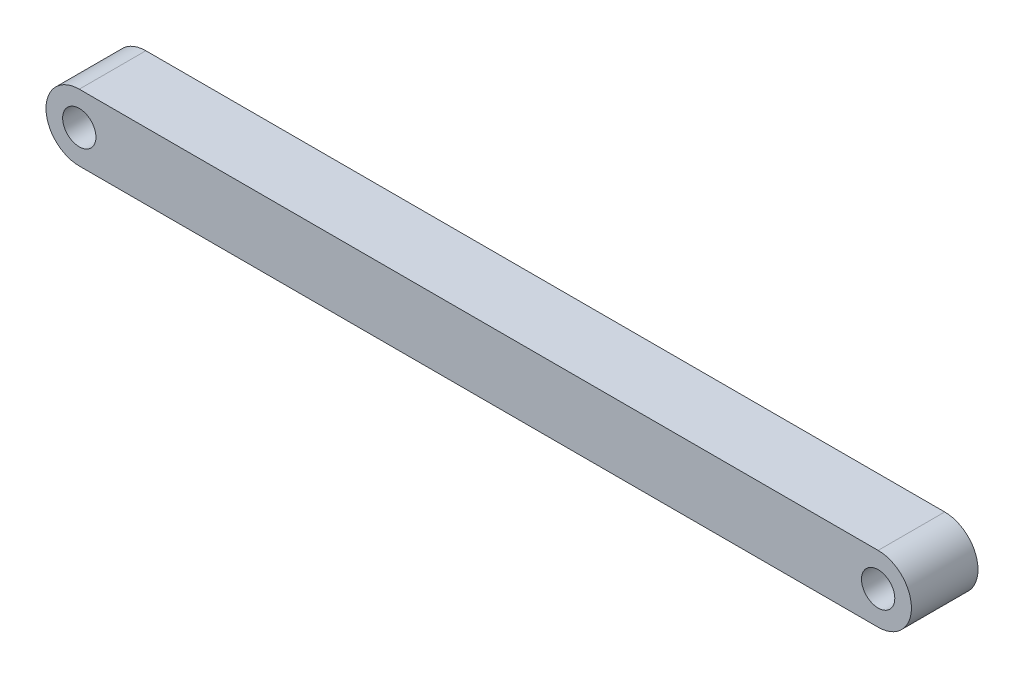
ISO-10303-21;
HEADER;
FILE_DESCRIPTION(('STEP AP214'),'2;1');
FILE_NAME('part.step','',(''),(''),'','','');
FILE_SCHEMA(('AUTOMOTIVE_DESIGN { 1 0 10303 214 1 1 1 1 }'));
ENDSEC;
DATA;
#1=APPLICATION_CONTEXT('core data for automotive mechanical design processes');
#2=APPLICATION_PROTOCOL_DEFINITION('international standard','automotive_design',2000,#1);
#3=PRODUCT_CONTEXT('',#1,'mechanical');
#4=PRODUCT('Part','Part','',(#3));
#5=PRODUCT_RELATED_PRODUCT_CATEGORY('part','',(#4));
#6=PRODUCT_DEFINITION_FORMATION('','',#4);
#7=PRODUCT_DEFINITION_CONTEXT('part definition',#1,'design');
#8=PRODUCT_DEFINITION('design','',#6,#7);
#9=PRODUCT_DEFINITION_SHAPE('','',#8);
#10=(LENGTH_UNIT() NAMED_UNIT(*) SI_UNIT(.MILLI.,.METRE.));
#11=(NAMED_UNIT(*) PLANE_ANGLE_UNIT() SI_UNIT($,.RADIAN.));
#12=(NAMED_UNIT(*) SI_UNIT($,.STERADIAN.) SOLID_ANGLE_UNIT());
#13=UNCERTAINTY_MEASURE_WITH_UNIT(LENGTH_MEASURE(1.E-05),#10,'distance_accuracy_value','');
#14=(GEOMETRIC_REPRESENTATION_CONTEXT(3) GLOBAL_UNCERTAINTY_ASSIGNED_CONTEXT((#13)) GLOBAL_UNIT_ASSIGNED_CONTEXT((#10,
#11,#12)) REPRESENTATION_CONTEXT('',''));
#15=CARTESIAN_POINT('',(0.,0.,0.));
#16=DIRECTION('',(0.,0.,1.));
#17=DIRECTION('',(1.,0.,0.));
#18=AXIS2_PLACEMENT_3D('',#15,#16,#17);
#19=CARTESIAN_POINT('',(-60.,0.,10.));
#20=DIRECTION('',(0.,0.,1.));
#21=DIRECTION('',(1.,0.,0.));
#22=AXIS2_PLACEMENT_3D('',#19,#20,#21);
#23=PLANE('',#22);
#24=CARTESIAN_POINT('',(-60.,0.,10.));
#25=DIRECTION('',(0.,0.,1.));
#26=DIRECTION('',(1.,0.,0.));
#27=AXIS2_PLACEMENT_3D('',#24,#25,#26);
#28=CIRCLE('',#27,2.5);
#29=CARTESIAN_POINT('',(-57.5,0.,10.));
#30=VERTEX_POINT('',#29);
#31=EDGE_CURVE('E115',#30,#30,#28,.T.);
#32=ORIENTED_EDGE('',*,*,#31,.F.);
#33=EDGE_LOOP('',(#32));
#34=FACE_BOUND('',#33,.T.);
#35=CARTESIAN_POINT('',(-60.,0.,10.));
#36=DIRECTION('',(0.,0.,1.));
#37=DIRECTION('',(1.,0.,0.));
#38=AXIS2_PLACEMENT_3D('',#35,#36,#37);
#39=CIRCLE('',#38,5.);
#40=CARTESIAN_POINT('',(-60.,5.,10.));
#41=VERTEX_POINT('',#40);
#42=CARTESIAN_POINT('',(-60.,-5.,10.));
#43=VERTEX_POINT('',#42);
#44=EDGE_CURVE('E95',#41,#43,#39,.T.);
#45=ORIENTED_EDGE('',*,*,#44,.T.);
#46=DIRECTION('',(1.,0.,0.));
#47=VECTOR('',#46,1.);
#48=CARTESIAN_POINT('',(-60.,-5.,10.));
#49=LINE('',#48,#47);
#50=CARTESIAN_POINT('',(60.,-5.00000000000002,10.));
#51=VERTEX_POINT('',#50);
#52=EDGE_CURVE('E90',#43,#51,#49,.T.);
#53=ORIENTED_EDGE('',*,*,#52,.T.);
#54=CARTESIAN_POINT('',(60.,0.,10.));
#55=DIRECTION('',(0.,0.,1.));
#56=DIRECTION('',(1.,0.,0.));
#57=AXIS2_PLACEMENT_3D('',#54,#55,#56);
#58=CIRCLE('',#57,5.);
#59=CARTESIAN_POINT('',(60.,4.99999999999998,10.));
#60=VERTEX_POINT('',#59);
#61=EDGE_CURVE('E93',#51,#60,#58,.T.);
#62=ORIENTED_EDGE('',*,*,#61,.T.);
#63=DIRECTION('',(-1.,0.,0.));
#64=VECTOR('',#63,1.);
#65=CARTESIAN_POINT('',(-60.,5.,10.));
#66=LINE('',#65,#64);
#67=EDGE_CURVE('E60',#60,#41,#66,.T.);
#68=ORIENTED_EDGE('',*,*,#67,.T.);
#69=EDGE_LOOP('',(#45,#53,#62,#68));
#70=FACE_BOUND('',#69,.T.);
#71=CARTESIAN_POINT('',(60.,0.,10.));
#72=DIRECTION('',(0.,0.,1.));
#73=DIRECTION('',(1.,0.,0.));
#74=AXIS2_PLACEMENT_3D('',#71,#72,#73);
#75=CIRCLE('',#74,2.49999999999999);
#76=CARTESIAN_POINT('',(62.5,0.,10.));
#77=VERTEX_POINT('',#76);
#78=EDGE_CURVE('E137',#77,#77,#75,.T.);
#79=ORIENTED_EDGE('',*,*,#78,.F.);
#80=EDGE_LOOP('',(#79));
#81=FACE_BOUND('',#80,.T.);
#82=ADVANCED_FACE('F42',(#34,#70,#81),#23,.T.);
#83=CARTESIAN_POINT('',(-60.,0.,0.));
#84=DIRECTION('',(0.,0.,1.));
#85=DIRECTION('',(1.,0.,0.));
#86=AXIS2_PLACEMENT_3D('',#83,#84,#85);
#87=PLANE('',#86);
#88=CARTESIAN_POINT('',(-60.,0.,0.));
#89=DIRECTION('',(0.,0.,1.));
#90=DIRECTION('',(1.,0.,0.));
#91=AXIS2_PLACEMENT_3D('',#88,#89,#90);
#92=CIRCLE('',#91,5.);
#93=CARTESIAN_POINT('',(-60.,5.,0.));
#94=VERTEX_POINT('',#93);
#95=CARTESIAN_POINT('',(-60.,-5.,0.));
#96=VERTEX_POINT('',#95);
#97=EDGE_CURVE('E111',#94,#96,#92,.T.);
#98=ORIENTED_EDGE('',*,*,#97,.F.);
#99=DIRECTION('',(-1.,0.,0.));
#100=VECTOR('',#99,1.);
#101=CARTESIAN_POINT('',(-60.,5.,0.));
#102=LINE('',#101,#100);
#103=CARTESIAN_POINT('',(60.,4.99999999999998,0.));
#104=VERTEX_POINT('',#103);
#105=EDGE_CURVE('E83',#104,#94,#102,.T.);
#106=ORIENTED_EDGE('',*,*,#105,.F.);
#107=CARTESIAN_POINT('',(60.,0.,0.));
#108=DIRECTION('',(0.,0.,1.));
#109=DIRECTION('',(1.,0.,0.));
#110=AXIS2_PLACEMENT_3D('',#107,#108,#109);
#111=CIRCLE('',#110,5.);
#112=CARTESIAN_POINT('',(60.,-5.00000000000002,0.));
#113=VERTEX_POINT('',#112);
#114=EDGE_CURVE('E77',#113,#104,#111,.T.);
#115=ORIENTED_EDGE('',*,*,#114,.F.);
#116=DIRECTION('',(1.,0.,0.));
#117=VECTOR('',#116,1.);
#118=CARTESIAN_POINT('',(-60.,-5.,0.));
#119=LINE('',#118,#117);
#120=EDGE_CURVE('E100',#96,#113,#119,.T.);
#121=ORIENTED_EDGE('',*,*,#120,.F.);
#122=EDGE_LOOP('',(#98,#106,#115,#121));
#123=FACE_BOUND('',#122,.T.);
#124=CARTESIAN_POINT('',(-60.,0.,0.));
#125=DIRECTION('',(0.,0.,1.));
#126=DIRECTION('',(1.,0.,0.));
#127=AXIS2_PLACEMENT_3D('',#124,#125,#126);
#128=CIRCLE('',#127,2.5);
#129=CARTESIAN_POINT('',(-57.5,0.,0.));
#130=VERTEX_POINT('',#129);
#131=EDGE_CURVE('E133',#130,#130,#128,.T.);
#132=ORIENTED_EDGE('',*,*,#131,.T.);
#133=EDGE_LOOP('',(#132));
#134=FACE_BOUND('',#133,.T.);
#135=CARTESIAN_POINT('',(60.,0.,0.));
#136=DIRECTION('',(0.,0.,1.));
#137=DIRECTION('',(1.,0.,0.));
#138=AXIS2_PLACEMENT_3D('',#135,#136,#137);
#139=CIRCLE('',#138,2.49999999999999);
#140=CARTESIAN_POINT('',(62.5,0.,0.));
#141=VERTEX_POINT('',#140);
#142=EDGE_CURVE('E141',#141,#141,#139,.T.);
#143=ORIENTED_EDGE('',*,*,#142,.T.);
#144=EDGE_LOOP('',(#143));
#145=FACE_BOUND('',#144,.T.);
#146=ADVANCED_FACE('F128',(#123,#134,#145),#87,.F.);
#147=CARTESIAN_POINT('',(-60.,0.,10.));
#148=DIRECTION('',(0.,0.,-1.));
#149=DIRECTION('',(-1.,0.,0.));
#150=AXIS2_PLACEMENT_3D('',#147,#148,#149);
#151=CYLINDRICAL_SURFACE('',#150,5.);
#152=ORIENTED_EDGE('',*,*,#97,.T.);
#153=DIRECTION('',(0.,0.,-1.));
#154=VECTOR('',#153,1.);
#155=CARTESIAN_POINT('',(-60.,-5.,10.));
#156=LINE('',#155,#154);
#157=EDGE_CURVE('E11',#43,#96,#156,.T.);
#158=ORIENTED_EDGE('',*,*,#157,.F.);
#159=ORIENTED_EDGE('',*,*,#44,.F.);
#160=DIRECTION('',(0.,0.,-1.));
#161=VECTOR('',#160,1.);
#162=CARTESIAN_POINT('',(-60.,5.,10.));
#163=LINE('',#162,#161);
#164=EDGE_CURVE('E107',#41,#94,#163,.T.);
#165=ORIENTED_EDGE('',*,*,#164,.T.);
#166=EDGE_LOOP('',(#152,#158,#159,#165));
#167=FACE_BOUND('',#166,.T.);
#168=ADVANCED_FACE('F44',(#167),#151,.T.);
#169=CARTESIAN_POINT('',(-60.,-5.,10.));
#170=DIRECTION('',(0.,1.,0.));
#171=DIRECTION('',(-1.,0.,0.));
#172=AXIS2_PLACEMENT_3D('',#169,#170,#171);
#173=PLANE('',#172);
#174=ORIENTED_EDGE('',*,*,#120,.T.);
#175=DIRECTION('',(0.,0.,-1.));
#176=VECTOR('',#175,1.);
#177=CARTESIAN_POINT('',(60.,-5.00000000000002,10.));
#178=LINE('',#177,#176);
#179=EDGE_CURVE('E52',#51,#113,#178,.T.);
#180=ORIENTED_EDGE('',*,*,#179,.F.);
#181=ORIENTED_EDGE('',*,*,#52,.F.);
#182=ORIENTED_EDGE('',*,*,#157,.T.);
#183=EDGE_LOOP('',(#174,#180,#181,#182));
#184=FACE_BOUND('',#183,.T.);
#185=ADVANCED_FACE('F99',(#184),#173,.F.);
#186=CARTESIAN_POINT('',(60.,0.,10.));
#187=DIRECTION('',(0.,0.,-1.));
#188=DIRECTION('',(-1.,0.,0.));
#189=AXIS2_PLACEMENT_3D('',#186,#187,#188);
#190=CYLINDRICAL_SURFACE('',#189,5.);
#191=ORIENTED_EDGE('',*,*,#114,.T.);
#192=DIRECTION('',(0.,0.,-1.));
#193=VECTOR('',#192,1.);
#194=CARTESIAN_POINT('',(60.,4.99999999999998,10.));
#195=LINE('',#194,#193);
#196=EDGE_CURVE('E102',#60,#104,#195,.T.);
#197=ORIENTED_EDGE('',*,*,#196,.F.);
#198=ORIENTED_EDGE('',*,*,#61,.F.);
#199=ORIENTED_EDGE('',*,*,#179,.T.);
#200=EDGE_LOOP('',(#191,#197,#198,#199));
#201=FACE_BOUND('',#200,.T.);
#202=ADVANCED_FACE('F103',(#201),#190,.T.);
#203=CARTESIAN_POINT('',(-60.,5.,10.));
#204=DIRECTION('',(0.,-1.,0.));
#205=DIRECTION('',(1.,0.,0.));
#206=AXIS2_PLACEMENT_3D('',#203,#204,#205);
#207=PLANE('',#206);
#208=ORIENTED_EDGE('',*,*,#105,.T.);
#209=ORIENTED_EDGE('',*,*,#164,.F.);
#210=ORIENTED_EDGE('',*,*,#67,.F.);
#211=ORIENTED_EDGE('',*,*,#196,.T.);
#212=EDGE_LOOP('',(#208,#209,#210,#211));
#213=FACE_BOUND('',#212,.T.);
#214=ADVANCED_FACE('F125',(#213),#207,.F.);
#215=CARTESIAN_POINT('',(-60.,0.,10.));
#216=DIRECTION('',(0.,0.,-1.));
#217=DIRECTION('',(-1.,0.,0.));
#218=AXIS2_PLACEMENT_3D('',#215,#216,#217);
#219=CYLINDRICAL_SURFACE('',#218,2.5);
#220=ORIENTED_EDGE('',*,*,#31,.T.);
#221=EDGE_LOOP('',(#220));
#222=FACE_BOUND('',#221,.T.);
#223=ORIENTED_EDGE('',*,*,#131,.F.);
#224=EDGE_LOOP('',(#223));
#225=FACE_BOUND('',#224,.T.);
#226=ADVANCED_FACE('F160',(#222,#225),#219,.F.);
#227=CARTESIAN_POINT('',(60.,0.,10.));
#228=DIRECTION('',(0.,0.,-1.));
#229=DIRECTION('',(-1.,0.,0.));
#230=AXIS2_PLACEMENT_3D('',#227,#228,#229);
#231=CYLINDRICAL_SURFACE('',#230,2.49999999999999);
#232=ORIENTED_EDGE('',*,*,#78,.T.);
#233=EDGE_LOOP('',(#232));
#234=FACE_BOUND('',#233,.T.);
#235=ORIENTED_EDGE('',*,*,#142,.F.);
#236=EDGE_LOOP('',(#235));
#237=FACE_BOUND('',#236,.T.);
#238=ADVANCED_FACE('F149',(#234,#237),#231,.F.);
#239=CLOSED_SHELL('',(#82,#146,#168,#185,#202,#214,#226,#238));
#240=MANIFOLD_SOLID_BREP('B2',#239);
#241=ADVANCED_BREP_SHAPE_REPRESENTATION('',(#18,#240),#14);
#242=SHAPE_DEFINITION_REPRESENTATION(#9,#241);
ENDSEC;
END-ISO-10303-21;
